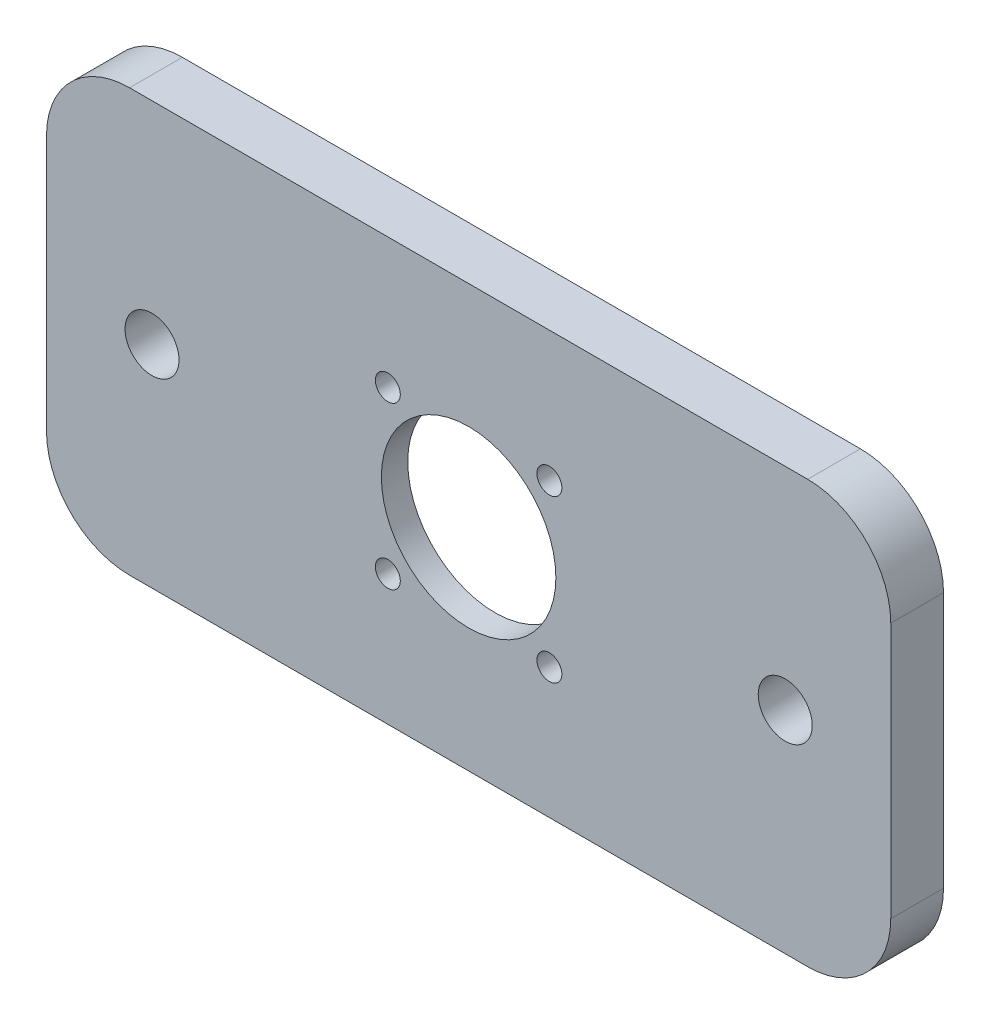
ISO-10303-21;
HEADER;
FILE_DESCRIPTION(('STEP AP214'),'2;1');
FILE_NAME('part.step','',(''),(''),'','','');
FILE_SCHEMA(('AUTOMOTIVE_DESIGN { 1 0 10303 214 1 1 1 1 }'));
ENDSEC;
DATA;
#1=APPLICATION_CONTEXT('core data for automotive mechanical design processes');
#2=APPLICATION_PROTOCOL_DEFINITION('international standard','automotive_design',2000,#1);
#3=PRODUCT_CONTEXT('',#1,'mechanical');
#4=PRODUCT('Part','Part','',(#3));
#5=PRODUCT_RELATED_PRODUCT_CATEGORY('part','',(#4));
#6=PRODUCT_DEFINITION_FORMATION('','',#4);
#7=PRODUCT_DEFINITION_CONTEXT('part definition',#1,'design');
#8=PRODUCT_DEFINITION('design','',#6,#7);
#9=PRODUCT_DEFINITION_SHAPE('','',#8);
#10=(LENGTH_UNIT() NAMED_UNIT(*) SI_UNIT(.MILLI.,.METRE.));
#11=(NAMED_UNIT(*) PLANE_ANGLE_UNIT() SI_UNIT($,.RADIAN.));
#12=(NAMED_UNIT(*) SI_UNIT($,.STERADIAN.) SOLID_ANGLE_UNIT());
#13=UNCERTAINTY_MEASURE_WITH_UNIT(LENGTH_MEASURE(1.E-05),#10,'distance_accuracy_value','');
#14=(GEOMETRIC_REPRESENTATION_CONTEXT(3) GLOBAL_UNCERTAINTY_ASSIGNED_CONTEXT((#13)) GLOBAL_UNIT_ASSIGNED_CONTEXT((#10,
#11,#12)) REPRESENTATION_CONTEXT('',''));
#15=CARTESIAN_POINT('',(0.,0.,0.));
#16=DIRECTION('',(0.,0.,1.));
#17=DIRECTION('',(1.,0.,0.));
#18=AXIS2_PLACEMENT_3D('',#15,#16,#17);
#19=CARTESIAN_POINT('',(0.,-0.237458689113023,6.35));
#20=DIRECTION('',(0.,0.,-1.));
#21=DIRECTION('',(-1.,0.,0.));
#22=AXIS2_PLACEMENT_3D('',#19,#20,#21);
#23=CYLINDRICAL_SURFACE('',#22,10.5);
#24=CARTESIAN_POINT('',(0.,-0.237458689113023,6.35));
#25=DIRECTION('',(0.,0.,1.));
#26=DIRECTION('',(1.,0.,0.));
#27=AXIS2_PLACEMENT_3D('',#24,#25,#26);
#28=CIRCLE('',#27,10.5);
#29=CARTESIAN_POINT('',(10.5,-0.237458689113023,6.35));
#30=VERTEX_POINT('',#29);
#31=EDGE_CURVE('E134',#30,#30,#28,.T.);
#32=ORIENTED_EDGE('',*,*,#31,.T.);
#33=EDGE_LOOP('',(#32));
#34=FACE_BOUND('',#33,.T.);
#35=CARTESIAN_POINT('',(0.,-0.237458689113023,3.175));
#36=DIRECTION('',(0.,0.,-1.));
#37=DIRECTION('',(-1.,0.,0.));
#38=AXIS2_PLACEMENT_3D('',#35,#36,#37);
#39=CIRCLE('',#38,10.5);
#40=CARTESIAN_POINT('',(-10.5,-0.237458689113023,3.175));
#41=VERTEX_POINT('',#40);
#42=EDGE_CURVE('E198',#41,#41,#39,.T.);
#43=ORIENTED_EDGE('',*,*,#42,.T.);
#44=EDGE_LOOP('',(#43));
#45=FACE_BOUND('',#44,.T.);
#46=ADVANCED_FACE('F36',(#34,#45),#23,.F.);
#47=CARTESIAN_POINT('',(-9.72,9.48254131088698,6.35));
#48=DIRECTION('',(0.,0.,-1.));
#49=DIRECTION('',(-1.,0.,0.));
#50=AXIS2_PLACEMENT_3D('',#47,#48,#49);
#51=CYLINDRICAL_SURFACE('',#50,1.5);
#52=CARTESIAN_POINT('',(-9.72,9.48254131088698,6.35));
#53=DIRECTION('',(0.,0.,1.));
#54=DIRECTION('',(1.,0.,0.));
#55=AXIS2_PLACEMENT_3D('',#52,#53,#54);
#56=CIRCLE('',#55,1.5);
#57=CARTESIAN_POINT('',(-8.22,9.48254131088698,6.35));
#58=VERTEX_POINT('',#57);
#59=EDGE_CURVE('E186',#58,#58,#56,.T.);
#60=ORIENTED_EDGE('',*,*,#59,.T.);
#61=EDGE_LOOP('',(#60));
#62=FACE_BOUND('',#61,.T.);
#63=CARTESIAN_POINT('',(-9.72,9.48254131088698,3.175));
#64=DIRECTION('',(0.,0.,-1.));
#65=DIRECTION('',(-1.,0.,0.));
#66=AXIS2_PLACEMENT_3D('',#63,#64,#65);
#67=CIRCLE('',#66,1.5);
#68=CARTESIAN_POINT('',(-11.22,9.48254131088698,3.175));
#69=VERTEX_POINT('',#68);
#70=EDGE_CURVE('E201',#69,#69,#67,.T.);
#71=ORIENTED_EDGE('',*,*,#70,.T.);
#72=EDGE_LOOP('',(#71));
#73=FACE_BOUND('',#72,.T.);
#74=ADVANCED_FACE('F283',(#62,#73),#51,.F.);
#75=CARTESIAN_POINT('',(9.72,9.48254131088698,6.35));
#76=DIRECTION('',(0.,0.,-1.));
#77=DIRECTION('',(-1.,0.,0.));
#78=AXIS2_PLACEMENT_3D('',#75,#76,#77);
#79=CYLINDRICAL_SURFACE('',#78,1.5);
#80=CARTESIAN_POINT('',(9.72,9.48254131088698,6.35));
#81=DIRECTION('',(0.,0.,1.));
#82=DIRECTION('',(1.,0.,0.));
#83=AXIS2_PLACEMENT_3D('',#80,#81,#82);
#84=CIRCLE('',#83,1.5);
#85=CARTESIAN_POINT('',(11.22,9.48254131088698,6.35));
#86=VERTEX_POINT('',#85);
#87=EDGE_CURVE('E189',#86,#86,#84,.T.);
#88=ORIENTED_EDGE('',*,*,#87,.T.);
#89=EDGE_LOOP('',(#88));
#90=FACE_BOUND('',#89,.T.);
#91=CARTESIAN_POINT('',(9.72,9.48254131088698,3.175));
#92=DIRECTION('',(0.,0.,-1.));
#93=DIRECTION('',(-1.,0.,0.));
#94=AXIS2_PLACEMENT_3D('',#91,#92,#93);
#95=CIRCLE('',#94,1.5);
#96=CARTESIAN_POINT('',(8.22000000000001,9.48254131088698,3.175));
#97=VERTEX_POINT('',#96);
#98=EDGE_CURVE('E204',#97,#97,#95,.T.);
#99=ORIENTED_EDGE('',*,*,#98,.T.);
#100=EDGE_LOOP('',(#99));
#101=FACE_BOUND('',#100,.T.);
#102=ADVANCED_FACE('F289',(#90,#101),#79,.F.);
#103=CARTESIAN_POINT('',(9.72,-9.95745868911302,6.35));
#104=DIRECTION('',(0.,0.,-1.));
#105=DIRECTION('',(-1.,0.,0.));
#106=AXIS2_PLACEMENT_3D('',#103,#104,#105);
#107=CYLINDRICAL_SURFACE('',#106,1.5);
#108=CARTESIAN_POINT('',(9.72,-9.95745868911302,6.35));
#109=DIRECTION('',(0.,0.,1.));
#110=DIRECTION('',(1.,0.,0.));
#111=AXIS2_PLACEMENT_3D('',#108,#109,#110);
#112=CIRCLE('',#111,1.5);
#113=CARTESIAN_POINT('',(11.22,-9.95745868911302,6.35));
#114=VERTEX_POINT('',#113);
#115=EDGE_CURVE('E192',#114,#114,#112,.T.);
#116=ORIENTED_EDGE('',*,*,#115,.T.);
#117=EDGE_LOOP('',(#116));
#118=FACE_BOUND('',#117,.T.);
#119=CARTESIAN_POINT('',(9.72,-9.95745868911302,3.175));
#120=DIRECTION('',(0.,0.,-1.));
#121=DIRECTION('',(-1.,0.,0.));
#122=AXIS2_PLACEMENT_3D('',#119,#120,#121);
#123=CIRCLE('',#122,1.5);
#124=CARTESIAN_POINT('',(8.22000000000001,-9.95745868911302,3.175));
#125=VERTEX_POINT('',#124);
#126=EDGE_CURVE('E143',#125,#125,#123,.T.);
#127=ORIENTED_EDGE('',*,*,#126,.T.);
#128=EDGE_LOOP('',(#127));
#129=FACE_BOUND('',#128,.T.);
#130=ADVANCED_FACE('F256',(#118,#129),#107,.F.);
#131=CARTESIAN_POINT('',(-9.72,-9.95745868911302,6.35));
#132=DIRECTION('',(0.,0.,-1.));
#133=DIRECTION('',(-1.,0.,0.));
#134=AXIS2_PLACEMENT_3D('',#131,#132,#133);
#135=CYLINDRICAL_SURFACE('',#134,1.5);
#136=CARTESIAN_POINT('',(-9.72,-9.95745868911302,6.35));
#137=DIRECTION('',(0.,0.,1.));
#138=DIRECTION('',(1.,0.,0.));
#139=AXIS2_PLACEMENT_3D('',#136,#137,#138);
#140=CIRCLE('',#139,1.5);
#141=CARTESIAN_POINT('',(-8.22,-9.95745868911302,6.35));
#142=VERTEX_POINT('',#141);
#143=EDGE_CURVE('E195',#142,#142,#140,.T.);
#144=ORIENTED_EDGE('',*,*,#143,.T.);
#145=EDGE_LOOP('',(#144));
#146=FACE_BOUND('',#145,.T.);
#147=CARTESIAN_POINT('',(-9.72,-9.95745868911302,3.175));
#148=DIRECTION('',(0.,0.,-1.));
#149=DIRECTION('',(-1.,0.,0.));
#150=AXIS2_PLACEMENT_3D('',#147,#148,#149);
#151=CIRCLE('',#150,1.5);
#152=CARTESIAN_POINT('',(-11.22,-9.95745868911302,3.175));
#153=VERTEX_POINT('',#152);
#154=EDGE_CURVE('E140',#153,#153,#151,.T.);
#155=ORIENTED_EDGE('',*,*,#154,.T.);
#156=EDGE_LOOP('',(#155));
#157=FACE_BOUND('',#156,.T.);
#158=ADVANCED_FACE('F239',(#146,#157),#135,.F.);
#159=CARTESIAN_POINT('',(0.,0.,6.35));
#160=DIRECTION('',(0.,0.,-1.));
#161=DIRECTION('',(-1.,0.,0.));
#162=AXIS2_PLACEMENT_3D('',#159,#160,#161);
#163=PLANE('',#162);
#164=CARTESIAN_POINT('',(-38.1,-0.237458689113026,6.35));
#165=DIRECTION('',(0.,0.,1.));
#166=DIRECTION('',(1.,0.,0.));
#167=AXIS2_PLACEMENT_3D('',#164,#165,#166);
#168=CIRCLE('',#167,3.25);
#169=CARTESIAN_POINT('',(-34.85,-0.237458689113026,6.35));
#170=VERTEX_POINT('',#169);
#171=EDGE_CURVE('E221',#170,#170,#168,.T.);
#172=ORIENTED_EDGE('',*,*,#171,.F.);
#173=EDGE_LOOP('',(#172));
#174=FACE_BOUND('',#173,.T.);
#175=CARTESIAN_POINT('',(38.1,-0.237458689113026,6.35));
#176=DIRECTION('',(0.,0.,1.));
#177=DIRECTION('',(-1.,0.,0.));
#178=AXIS2_PLACEMENT_3D('',#175,#176,#177);
#179=CIRCLE('',#178,3.25);
#180=CARTESIAN_POINT('',(34.85,-0.237458689113026,6.35));
#181=VERTEX_POINT('',#180);
#182=EDGE_CURVE('E215',#181,#181,#179,.T.);
#183=ORIENTED_EDGE('',*,*,#182,.F.);
#184=EDGE_LOOP('',(#183));
#185=FACE_BOUND('',#184,.T.);
#186=DIRECTION('',(0.,1.,0.));
#187=VECTOR('',#186,1.);
#188=CARTESIAN_POINT('',(50.8,-25.637458689113,6.35));
#189=LINE('',#188,#187);
#190=CARTESIAN_POINT('',(50.8,-15.637458689113,6.35));
#191=VERTEX_POINT('',#190);
#192=CARTESIAN_POINT('',(50.8,15.162541310887,6.35));
#193=VERTEX_POINT('',#192);
#194=EDGE_CURVE('E139',#191,#193,#189,.T.);
#195=ORIENTED_EDGE('',*,*,#194,.T.);
#196=CARTESIAN_POINT('',(40.8,15.162541310887,6.35));
#197=DIRECTION('',(0.,0.,-1.));
#198=DIRECTION('',(-1.,0.,0.));
#199=AXIS2_PLACEMENT_3D('',#196,#197,#198);
#200=CIRCLE('',#199,10.);
#201=CARTESIAN_POINT('',(40.8,25.162541310887,6.35));
#202=VERTEX_POINT('',#201);
#203=EDGE_CURVE('E159',#193,#202,#200,.F.);
#204=ORIENTED_EDGE('',*,*,#203,.T.);
#205=DIRECTION('',(-1.,0.,0.));
#206=VECTOR('',#205,1.);
#207=CARTESIAN_POINT('',(-50.8,25.162541310887,6.35));
#208=LINE('',#207,#206);
#209=CARTESIAN_POINT('',(-40.8,25.162541310887,6.35));
#210=VERTEX_POINT('',#209);
#211=EDGE_CURVE('E122',#202,#210,#208,.T.);
#212=ORIENTED_EDGE('',*,*,#211,.T.);
#213=CARTESIAN_POINT('',(-40.8,15.162541310887,6.35));
#214=DIRECTION('',(0.,0.,-1.));
#215=DIRECTION('',(-1.,0.,0.));
#216=AXIS2_PLACEMENT_3D('',#213,#214,#215);
#217=CIRCLE('',#216,10.);
#218=CARTESIAN_POINT('',(-50.8,15.162541310887,6.35));
#219=VERTEX_POINT('',#218);
#220=EDGE_CURVE('E154',#210,#219,#217,.F.);
#221=ORIENTED_EDGE('',*,*,#220,.T.);
#222=DIRECTION('',(0.,-1.,0.));
#223=VECTOR('',#222,1.);
#224=CARTESIAN_POINT('',(-50.8,-25.637458689113,6.35));
#225=LINE('',#224,#223);
#226=CARTESIAN_POINT('',(-50.8,-15.637458689113,6.35));
#227=VERTEX_POINT('',#226);
#228=EDGE_CURVE('E170',#219,#227,#225,.T.);
#229=ORIENTED_EDGE('',*,*,#228,.T.);
#230=CARTESIAN_POINT('',(-40.8,-15.637458689113,6.35));
#231=DIRECTION('',(0.,0.,-1.));
#232=DIRECTION('',(-1.,0.,0.));
#233=AXIS2_PLACEMENT_3D('',#230,#231,#232);
#234=CIRCLE('',#233,10.);
#235=CARTESIAN_POINT('',(-40.8,-25.637458689113,6.35));
#236=VERTEX_POINT('',#235);
#237=EDGE_CURVE('E58',#227,#236,#234,.F.);
#238=ORIENTED_EDGE('',*,*,#237,.T.);
#239=DIRECTION('',(1.,0.,0.));
#240=VECTOR('',#239,1.);
#241=CARTESIAN_POINT('',(-50.8,-25.637458689113,6.35));
#242=LINE('',#241,#240);
#243=CARTESIAN_POINT('',(40.8,-25.637458689113,6.35));
#244=VERTEX_POINT('',#243);
#245=EDGE_CURVE('E145',#236,#244,#242,.T.);
#246=ORIENTED_EDGE('',*,*,#245,.T.);
#247=CARTESIAN_POINT('',(40.8,-15.637458689113,6.35));
#248=DIRECTION('',(0.,0.,-1.));
#249=DIRECTION('',(-1.,0.,0.));
#250=AXIS2_PLACEMENT_3D('',#247,#248,#249);
#251=CIRCLE('',#250,10.);
#252=EDGE_CURVE('E157',#244,#191,#251,.F.);
#253=ORIENTED_EDGE('',*,*,#252,.T.);
#254=EDGE_LOOP('',(#195,#204,#212,#221,#229,#238,#246,#253));
#255=FACE_BOUND('',#254,.T.);
#256=ORIENTED_EDGE('',*,*,#31,.F.);
#257=EDGE_LOOP('',(#256));
#258=FACE_BOUND('',#257,.T.);
#259=ORIENTED_EDGE('',*,*,#59,.F.);
#260=EDGE_LOOP('',(#259));
#261=FACE_BOUND('',#260,.T.);
#262=ORIENTED_EDGE('',*,*,#87,.F.);
#263=EDGE_LOOP('',(#262));
#264=FACE_BOUND('',#263,.T.);
#265=ORIENTED_EDGE('',*,*,#115,.F.);
#266=EDGE_LOOP('',(#265));
#267=FACE_BOUND('',#266,.T.);
#268=ORIENTED_EDGE('',*,*,#143,.F.);
#269=EDGE_LOOP('',(#268));
#270=FACE_BOUND('',#269,.T.);
#271=ADVANCED_FACE('F236',(#174,#185,#255,#258,#261,#264,#267,#270),#163,.F.);
#272=CARTESIAN_POINT('',(0.,0.,0.));
#273=DIRECTION('',(0.,0.,-1.));
#274=DIRECTION('',(-1.,0.,0.));
#275=AXIS2_PLACEMENT_3D('',#272,#273,#274);
#276=PLANE('',#275);
#277=CARTESIAN_POINT('',(-38.1,-0.237458689113026,0.));
#278=DIRECTION('',(0.,0.,1.));
#279=DIRECTION('',(1.,0.,0.));
#280=AXIS2_PLACEMENT_3D('',#277,#278,#279);
#281=CIRCLE('',#280,3.25);
#282=CARTESIAN_POINT('',(-34.85,-0.237458689113026,0.));
#283=VERTEX_POINT('',#282);
#284=EDGE_CURVE('E212',#283,#283,#281,.T.);
#285=ORIENTED_EDGE('',*,*,#284,.T.);
#286=EDGE_LOOP('',(#285));
#287=FACE_BOUND('',#286,.T.);
#288=CARTESIAN_POINT('',(38.1,-0.237458689113026,0.));
#289=DIRECTION('',(0.,0.,1.));
#290=DIRECTION('',(-1.,0.,0.));
#291=AXIS2_PLACEMENT_3D('',#288,#289,#290);
#292=CIRCLE('',#291,3.25);
#293=CARTESIAN_POINT('',(34.85,-0.237458689113026,0.));
#294=VERTEX_POINT('',#293);
#295=EDGE_CURVE('E218',#294,#294,#292,.T.);
#296=ORIENTED_EDGE('',*,*,#295,.T.);
#297=EDGE_LOOP('',(#296));
#298=FACE_BOUND('',#297,.T.);
#299=CARTESIAN_POINT('',(0.,0.,0.));
#300=DIRECTION('',(0.,0.,-1.));
#301=DIRECTION('',(-1.,0.,0.));
#302=AXIS2_PLACEMENT_3D('',#299,#300,#301);
#303=CIRCLE('',#302,21.);
#304=CARTESIAN_POINT('',(-21.,0.,0.));
#305=VERTEX_POINT('',#304);
#306=EDGE_CURVE('E209',#305,#305,#303,.T.);
#307=ORIENTED_EDGE('',*,*,#306,.F.);
#308=EDGE_LOOP('',(#307));
#309=FACE_BOUND('',#308,.T.);
#310=DIRECTION('',(-1.,0.,0.));
#311=VECTOR('',#310,1.);
#312=CARTESIAN_POINT('',(-50.8,25.162541310887,0.));
#313=LINE('',#312,#311);
#314=CARTESIAN_POINT('',(40.8,25.162541310887,0.));
#315=VERTEX_POINT('',#314);
#316=CARTESIAN_POINT('',(-40.8,25.162541310887,0.));
#317=VERTEX_POINT('',#316);
#318=EDGE_CURVE('E119',#315,#317,#313,.T.);
#319=ORIENTED_EDGE('',*,*,#318,.F.);
#320=CARTESIAN_POINT('',(40.8,15.162541310887,0.));
#321=DIRECTION('',(0.,0.,-1.));
#322=DIRECTION('',(-1.,0.,0.));
#323=AXIS2_PLACEMENT_3D('',#320,#321,#322);
#324=CIRCLE('',#323,10.);
#325=CARTESIAN_POINT('',(50.8,15.162541310887,0.));
#326=VERTEX_POINT('',#325);
#327=EDGE_CURVE('E102',#315,#326,#324,.T.);
#328=ORIENTED_EDGE('',*,*,#327,.T.);
#329=DIRECTION('',(0.,1.,0.));
#330=VECTOR('',#329,1.);
#331=CARTESIAN_POINT('',(50.8,-25.637458689113,0.));
#332=LINE('',#331,#330);
#333=CARTESIAN_POINT('',(50.8,-15.637458689113,0.));
#334=VERTEX_POINT('',#333);
#335=EDGE_CURVE('E129',#334,#326,#332,.T.);
#336=ORIENTED_EDGE('',*,*,#335,.F.);
#337=CARTESIAN_POINT('',(40.8,-15.637458689113,0.));
#338=DIRECTION('',(0.,0.,-1.));
#339=DIRECTION('',(-1.,0.,0.));
#340=AXIS2_PLACEMENT_3D('',#337,#338,#339);
#341=CIRCLE('',#340,10.);
#342=CARTESIAN_POINT('',(40.8,-25.637458689113,0.));
#343=VERTEX_POINT('',#342);
#344=EDGE_CURVE('E113',#334,#343,#341,.T.);
#345=ORIENTED_EDGE('',*,*,#344,.T.);
#346=DIRECTION('',(1.,0.,0.));
#347=VECTOR('',#346,1.);
#348=CARTESIAN_POINT('',(-50.8,-25.637458689113,0.));
#349=LINE('',#348,#347);
#350=CARTESIAN_POINT('',(-40.8,-25.637458689113,0.));
#351=VERTEX_POINT('',#350);
#352=EDGE_CURVE('E132',#351,#343,#349,.T.);
#353=ORIENTED_EDGE('',*,*,#352,.F.);
#354=CARTESIAN_POINT('',(-40.8,-15.637458689113,0.));
#355=DIRECTION('',(0.,0.,-1.));
#356=DIRECTION('',(-1.,0.,0.));
#357=AXIS2_PLACEMENT_3D('',#354,#355,#356);
#358=CIRCLE('',#357,10.);
#359=CARTESIAN_POINT('',(-50.8,-15.637458689113,0.));
#360=VERTEX_POINT('',#359);
#361=EDGE_CURVE('E148',#351,#360,#358,.T.);
#362=ORIENTED_EDGE('',*,*,#361,.T.);
#363=DIRECTION('',(0.,-1.,0.));
#364=VECTOR('',#363,1.);
#365=CARTESIAN_POINT('',(-50.8,-25.637458689113,0.));
#366=LINE('',#365,#364);
#367=CARTESIAN_POINT('',(-50.8,15.162541310887,0.));
#368=VERTEX_POINT('',#367);
#369=EDGE_CURVE('E128',#368,#360,#366,.T.);
#370=ORIENTED_EDGE('',*,*,#369,.F.);
#371=CARTESIAN_POINT('',(-40.8,15.162541310887,0.));
#372=DIRECTION('',(0.,0.,-1.));
#373=DIRECTION('',(-1.,0.,0.));
#374=AXIS2_PLACEMENT_3D('',#371,#372,#373);
#375=CIRCLE('',#374,10.);
#376=EDGE_CURVE('E123',#368,#317,#375,.T.);
#377=ORIENTED_EDGE('',*,*,#376,.T.);
#378=EDGE_LOOP('',(#319,#328,#336,#345,#353,#362,#370,#377));
#379=FACE_BOUND('',#378,.T.);
#380=ADVANCED_FACE('F126',(#287,#298,#309,#379),#276,.T.);
#381=CARTESIAN_POINT('',(50.8,-25.637458689113,6.35));
#382=DIRECTION('',(-1.,0.,0.));
#383=DIRECTION('',(0.,0.,1.));
#384=AXIS2_PLACEMENT_3D('',#381,#382,#383);
#385=PLANE('',#384);
#386=ORIENTED_EDGE('',*,*,#335,.T.);
#387=DIRECTION('',(0.,0.,-1.));
#388=VECTOR('',#387,1.);
#389=CARTESIAN_POINT('',(50.8,15.162541310887,6.35));
#390=LINE('',#389,#388);
#391=EDGE_CURVE('E107',#326,#193,#390,.F.);
#392=ORIENTED_EDGE('',*,*,#391,.T.);
#393=ORIENTED_EDGE('',*,*,#194,.F.);
#394=DIRECTION('',(0.,0.,-1.));
#395=VECTOR('',#394,1.);
#396=CARTESIAN_POINT('',(50.8,-15.637458689113,6.35));
#397=LINE('',#396,#395);
#398=EDGE_CURVE('E112',#191,#334,#397,.T.);
#399=ORIENTED_EDGE('',*,*,#398,.T.);
#400=EDGE_LOOP('',(#386,#392,#393,#399));
#401=FACE_BOUND('',#400,.T.);
#402=ADVANCED_FACE('F274',(#401),#385,.F.);
#403=CARTESIAN_POINT('',(-50.8,25.162541310887,6.35));
#404=DIRECTION('',(0.,-1.,0.));
#405=DIRECTION('',(0.,0.,-1.));
#406=AXIS2_PLACEMENT_3D('',#403,#404,#405);
#407=PLANE('',#406);
#408=ORIENTED_EDGE('',*,*,#211,.F.);
#409=DIRECTION('',(0.,0.,-1.));
#410=VECTOR('',#409,1.);
#411=CARTESIAN_POINT('',(40.8,25.162541310887,6.35));
#412=LINE('',#411,#410);
#413=EDGE_CURVE('E106',#202,#315,#412,.T.);
#414=ORIENTED_EDGE('',*,*,#413,.T.);
#415=ORIENTED_EDGE('',*,*,#318,.T.);
#416=DIRECTION('',(0.,0.,-1.));
#417=VECTOR('',#416,1.);
#418=CARTESIAN_POINT('',(-40.8,25.162541310887,6.35));
#419=LINE('',#418,#417);
#420=EDGE_CURVE('E124',#317,#210,#419,.F.);
#421=ORIENTED_EDGE('',*,*,#420,.T.);
#422=EDGE_LOOP('',(#408,#414,#415,#421));
#423=FACE_BOUND('',#422,.T.);
#424=ADVANCED_FACE('F118',(#423),#407,.F.);
#425=CARTESIAN_POINT('',(-50.8,-25.637458689113,6.35));
#426=DIRECTION('',(1.,0.,0.));
#427=DIRECTION('',(0.,0.,-1.));
#428=AXIS2_PLACEMENT_3D('',#425,#426,#427);
#429=PLANE('',#428);
#430=ORIENTED_EDGE('',*,*,#369,.T.);
#431=DIRECTION('',(0.,0.,-1.));
#432=VECTOR('',#431,1.);
#433=CARTESIAN_POINT('',(-50.8,-15.637458689113,6.35));
#434=LINE('',#433,#432);
#435=EDGE_CURVE('E11',#360,#227,#434,.F.);
#436=ORIENTED_EDGE('',*,*,#435,.T.);
#437=ORIENTED_EDGE('',*,*,#228,.F.);
#438=DIRECTION('',(0.,0.,-1.));
#439=VECTOR('',#438,1.);
#440=CARTESIAN_POINT('',(-50.8,15.162541310887,6.35));
#441=LINE('',#440,#439);
#442=EDGE_CURVE('E44',#219,#368,#441,.T.);
#443=ORIENTED_EDGE('',*,*,#442,.T.);
#444=EDGE_LOOP('',(#430,#436,#437,#443));
#445=FACE_BOUND('',#444,.T.);
#446=ADVANCED_FACE('F168',(#445),#429,.F.);
#447=CARTESIAN_POINT('',(-50.8,-25.637458689113,6.35));
#448=DIRECTION('',(0.,1.,0.));
#449=DIRECTION('',(0.,0.,1.));
#450=AXIS2_PLACEMENT_3D('',#447,#448,#449);
#451=PLANE('',#450);
#452=ORIENTED_EDGE('',*,*,#352,.T.);
#453=DIRECTION('',(0.,0.,-1.));
#454=VECTOR('',#453,1.);
#455=CARTESIAN_POINT('',(40.8,-25.637458689113,6.35));
#456=LINE('',#455,#454);
#457=EDGE_CURVE('E51',#343,#244,#456,.F.);
#458=ORIENTED_EDGE('',*,*,#457,.T.);
#459=ORIENTED_EDGE('',*,*,#245,.F.);
#460=DIRECTION('',(0.,0.,-1.));
#461=VECTOR('',#460,1.);
#462=CARTESIAN_POINT('',(-40.8,-25.637458689113,6.35));
#463=LINE('',#462,#461);
#464=EDGE_CURVE('E161',#236,#351,#463,.T.);
#465=ORIENTED_EDGE('',*,*,#464,.T.);
#466=EDGE_LOOP('',(#452,#458,#459,#465));
#467=FACE_BOUND('',#466,.T.);
#468=ADVANCED_FACE('F177',(#467),#451,.F.);
#469=CARTESIAN_POINT('',(0.,0.,3.175));
#470=DIRECTION('',(0.,0.,-1.));
#471=DIRECTION('',(-1.,0.,0.));
#472=AXIS2_PLACEMENT_3D('',#469,#470,#471);
#473=CYLINDRICAL_SURFACE('',#472,21.);
#474=CARTESIAN_POINT('',(0.,0.,3.175));
#475=DIRECTION('',(0.,0.,-1.));
#476=DIRECTION('',(-1.,0.,0.));
#477=AXIS2_PLACEMENT_3D('',#474,#475,#476);
#478=CIRCLE('',#477,21.);
#479=CARTESIAN_POINT('',(-21.,0.,3.175));
#480=VERTEX_POINT('',#479);
#481=EDGE_CURVE('E144',#480,#480,#478,.T.);
#482=ORIENTED_EDGE('',*,*,#481,.F.);
#483=EDGE_LOOP('',(#482));
#484=FACE_BOUND('',#483,.T.);
#485=ORIENTED_EDGE('',*,*,#306,.T.);
#486=EDGE_LOOP('',(#485));
#487=FACE_BOUND('',#486,.T.);
#488=ADVANCED_FACE('F263',(#484,#487),#473,.F.);
#489=CARTESIAN_POINT('',(0.,0.,3.175));
#490=DIRECTION('',(0.,0.,-1.));
#491=DIRECTION('',(-1.,0.,0.));
#492=AXIS2_PLACEMENT_3D('',#489,#490,#491);
#493=PLANE('',#492);
#494=ORIENTED_EDGE('',*,*,#42,.F.);
#495=EDGE_LOOP('',(#494));
#496=FACE_BOUND('',#495,.T.);
#497=ORIENTED_EDGE('',*,*,#70,.F.);
#498=EDGE_LOOP('',(#497));
#499=FACE_BOUND('',#498,.T.);
#500=ORIENTED_EDGE('',*,*,#98,.F.);
#501=EDGE_LOOP('',(#500));
#502=FACE_BOUND('',#501,.T.);
#503=ORIENTED_EDGE('',*,*,#126,.F.);
#504=EDGE_LOOP('',(#503));
#505=FACE_BOUND('',#504,.T.);
#506=ORIENTED_EDGE('',*,*,#154,.F.);
#507=EDGE_LOOP('',(#506));
#508=FACE_BOUND('',#507,.T.);
#509=ORIENTED_EDGE('',*,*,#481,.T.);
#510=EDGE_LOOP('',(#509));
#511=FACE_BOUND('',#510,.T.);
#512=ADVANCED_FACE('F260',(#496,#499,#502,#505,#508,#511),#493,.T.);
#513=CARTESIAN_POINT('',(38.1,-0.237458689113026,0.));
#514=DIRECTION('',(0.,0.,1.));
#515=DIRECTION('',(1.,0.,0.));
#516=AXIS2_PLACEMENT_3D('',#513,#514,#515);
#517=CYLINDRICAL_SURFACE('',#516,3.25);
#518=ORIENTED_EDGE('',*,*,#295,.F.);
#519=EDGE_LOOP('',(#518));
#520=FACE_BOUND('',#519,.T.);
#521=ORIENTED_EDGE('',*,*,#182,.T.);
#522=EDGE_LOOP('',(#521));
#523=FACE_BOUND('',#522,.T.);
#524=ADVANCED_FACE('F232',(#520,#523),#517,.F.);
#525=CARTESIAN_POINT('',(-38.1,-0.237458689113026,0.));
#526=DIRECTION('',(0.,0.,1.));
#527=DIRECTION('',(1.,0.,0.));
#528=AXIS2_PLACEMENT_3D('',#525,#526,#527);
#529=CYLINDRICAL_SURFACE('',#528,3.25);
#530=ORIENTED_EDGE('',*,*,#284,.F.);
#531=EDGE_LOOP('',(#530));
#532=FACE_BOUND('',#531,.T.);
#533=ORIENTED_EDGE('',*,*,#171,.T.);
#534=EDGE_LOOP('',(#533));
#535=FACE_BOUND('',#534,.T.);
#536=ADVANCED_FACE('F229',(#532,#535),#529,.F.);
#537=CARTESIAN_POINT('',(40.8,15.162541310887,6.35));
#538=DIRECTION('',(0.,0.,-1.));
#539=DIRECTION('',(-1.,0.,0.));
#540=AXIS2_PLACEMENT_3D('',#537,#538,#539);
#541=CYLINDRICAL_SURFACE('',#540,10.);
#542=ORIENTED_EDGE('',*,*,#203,.F.);
#543=ORIENTED_EDGE('',*,*,#391,.F.);
#544=ORIENTED_EDGE('',*,*,#327,.F.);
#545=ORIENTED_EDGE('',*,*,#413,.F.);
#546=EDGE_LOOP('',(#542,#543,#544,#545));
#547=FACE_BOUND('',#546,.T.);
#548=ADVANCED_FACE('F105',(#547),#541,.T.);
#549=CARTESIAN_POINT('',(40.8,-15.637458689113,6.35));
#550=DIRECTION('',(0.,0.,-1.));
#551=DIRECTION('',(-1.,0.,0.));
#552=AXIS2_PLACEMENT_3D('',#549,#550,#551);
#553=CYLINDRICAL_SURFACE('',#552,10.);
#554=ORIENTED_EDGE('',*,*,#252,.F.);
#555=ORIENTED_EDGE('',*,*,#457,.F.);
#556=ORIENTED_EDGE('',*,*,#344,.F.);
#557=ORIENTED_EDGE('',*,*,#398,.F.);
#558=EDGE_LOOP('',(#554,#555,#556,#557));
#559=FACE_BOUND('',#558,.T.);
#560=ADVANCED_FACE('F319',(#559),#553,.T.);
#561=CARTESIAN_POINT('',(-40.8,-15.637458689113,6.35));
#562=DIRECTION('',(0.,0.,-1.));
#563=DIRECTION('',(-1.,0.,0.));
#564=AXIS2_PLACEMENT_3D('',#561,#562,#563);
#565=CYLINDRICAL_SURFACE('',#564,10.);
#566=ORIENTED_EDGE('',*,*,#237,.F.);
#567=ORIENTED_EDGE('',*,*,#435,.F.);
#568=ORIENTED_EDGE('',*,*,#361,.F.);
#569=ORIENTED_EDGE('',*,*,#464,.F.);
#570=EDGE_LOOP('',(#566,#567,#568,#569));
#571=FACE_BOUND('',#570,.T.);
#572=ADVANCED_FACE('F176',(#571),#565,.T.);
#573=CARTESIAN_POINT('',(-40.8,15.162541310887,6.35));
#574=DIRECTION('',(0.,0.,-1.));
#575=DIRECTION('',(-1.,0.,0.));
#576=AXIS2_PLACEMENT_3D('',#573,#574,#575);
#577=CYLINDRICAL_SURFACE('',#576,10.);
#578=ORIENTED_EDGE('',*,*,#220,.F.);
#579=ORIENTED_EDGE('',*,*,#420,.F.);
#580=ORIENTED_EDGE('',*,*,#376,.F.);
#581=ORIENTED_EDGE('',*,*,#442,.F.);
#582=EDGE_LOOP('',(#578,#579,#580,#581));
#583=FACE_BOUND('',#582,.T.);
#584=ADVANCED_FACE('F38',(#583),#577,.T.);
#585=CLOSED_SHELL('',(#46,#74,#102,#130,#158,#271,#380,#402,#424,#446,#468,#488,#512,#524,#536,
#548,#560,#572,#584));
#586=MANIFOLD_SOLID_BREP('B2',#585);
#587=ADVANCED_BREP_SHAPE_REPRESENTATION('',(#18,#586),#14);
#588=SHAPE_DEFINITION_REPRESENTATION(#9,#587);
ENDSEC;
END-ISO-10303-21;
